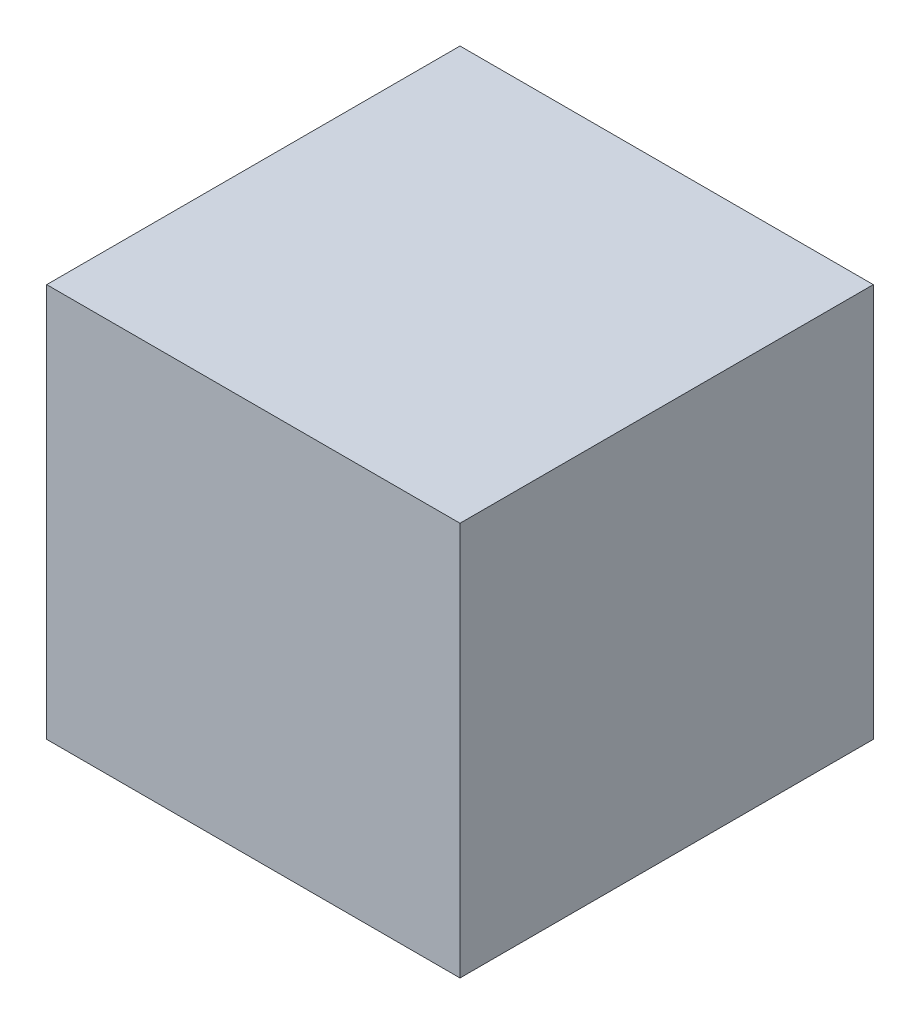
ISO-10303-21;
HEADER;
FILE_DESCRIPTION(('STEP AP214'),'2;1');
FILE_NAME('part.step','',(''),(''),'','','');
FILE_SCHEMA(('AUTOMOTIVE_DESIGN { 1 0 10303 214 1 1 1 1 }'));
ENDSEC;
DATA;
#1=APPLICATION_CONTEXT('core data for automotive mechanical design processes');
#2=APPLICATION_PROTOCOL_DEFINITION('international standard','automotive_design',2000,#1);
#3=PRODUCT_CONTEXT('',#1,'mechanical');
#4=PRODUCT('Part','Part','',(#3));
#5=PRODUCT_RELATED_PRODUCT_CATEGORY('part','',(#4));
#6=PRODUCT_DEFINITION_FORMATION('','',#4);
#7=PRODUCT_DEFINITION_CONTEXT('part definition',#1,'design');
#8=PRODUCT_DEFINITION('design','',#6,#7);
#9=PRODUCT_DEFINITION_SHAPE('','',#8);
#10=(LENGTH_UNIT() NAMED_UNIT(*) SI_UNIT(.MILLI.,.METRE.));
#11=(NAMED_UNIT(*) PLANE_ANGLE_UNIT() SI_UNIT($,.RADIAN.));
#12=(NAMED_UNIT(*) SI_UNIT($,.STERADIAN.) SOLID_ANGLE_UNIT());
#13=UNCERTAINTY_MEASURE_WITH_UNIT(LENGTH_MEASURE(1.E-05),#10,'distance_accuracy_value','');
#14=(GEOMETRIC_REPRESENTATION_CONTEXT(3) GLOBAL_UNCERTAINTY_ASSIGNED_CONTEXT((#13)) GLOBAL_UNIT_ASSIGNED_CONTEXT((#10,
#11,#12)) REPRESENTATION_CONTEXT('',''));
#15=CARTESIAN_POINT('',(0.,0.,0.));
#16=DIRECTION('',(0.,0.,1.));
#17=DIRECTION('',(1.,0.,0.));
#18=AXIS2_PLACEMENT_3D('',#15,#16,#17);
#19=CARTESIAN_POINT('',(0.,40.25,0.));
#20=DIRECTION('',(1.,0.,0.));
#21=DIRECTION('',(0.,0.,-1.));
#22=AXIS2_PLACEMENT_3D('',#19,#20,#21);
#23=PLANE('',#22);
#24=DIRECTION('',(0.,0.,1.));
#25=VECTOR('',#24,1.);
#26=CARTESIAN_POINT('',(0.,0.,0.));
#27=LINE('',#26,#25);
#28=CARTESIAN_POINT('',(0.,0.,-42.24));
#29=VERTEX_POINT('',#28);
#30=CARTESIAN_POINT('',(0.,0.,0.));
#31=VERTEX_POINT('',#30);
#32=EDGE_CURVE('E95',#29,#31,#27,.T.);
#33=ORIENTED_EDGE('',*,*,#32,.T.);
#34=DIRECTION('',(0.,-1.,0.));
#35=VECTOR('',#34,1.);
#36=CARTESIAN_POINT('',(0.,40.25,0.));
#37=LINE('',#36,#35);
#38=CARTESIAN_POINT('',(0.,40.25,0.));
#39=VERTEX_POINT('',#38);
#40=EDGE_CURVE('E11',#39,#31,#37,.T.);
#41=ORIENTED_EDGE('',*,*,#40,.F.);
#42=DIRECTION('',(0.,0.,1.));
#43=VECTOR('',#42,1.);
#44=CARTESIAN_POINT('',(0.,40.25,0.));
#45=LINE('',#44,#43);
#46=CARTESIAN_POINT('',(0.,40.25,-42.24));
#47=VERTEX_POINT('',#46);
#48=EDGE_CURVE('E83',#47,#39,#45,.T.);
#49=ORIENTED_EDGE('',*,*,#48,.F.);
#50=DIRECTION('',(0.,-1.,0.));
#51=VECTOR('',#50,1.);
#52=CARTESIAN_POINT('',(0.,40.25,-42.24));
#53=LINE('',#52,#51);
#54=EDGE_CURVE('E91',#47,#29,#53,.T.);
#55=ORIENTED_EDGE('',*,*,#54,.T.);
#56=EDGE_LOOP('',(#33,#41,#49,#55));
#57=FACE_BOUND('',#56,.T.);
#58=ADVANCED_FACE('F32',(#57),#23,.F.);
#59=CARTESIAN_POINT('',(0.,40.25,0.));
#60=DIRECTION('',(0.,0.,-1.));
#61=DIRECTION('',(-1.,0.,0.));
#62=AXIS2_PLACEMENT_3D('',#59,#60,#61);
#63=PLANE('',#62);
#64=DIRECTION('',(1.,0.,0.));
#65=VECTOR('',#64,1.);
#66=CARTESIAN_POINT('',(0.,0.,0.));
#67=LINE('',#66,#65);
#68=CARTESIAN_POINT('',(42.24,0.,0.));
#69=VERTEX_POINT('',#68);
#70=EDGE_CURVE('E87',#31,#69,#67,.T.);
#71=ORIENTED_EDGE('',*,*,#70,.T.);
#72=DIRECTION('',(0.,-1.,0.));
#73=VECTOR('',#72,1.);
#74=CARTESIAN_POINT('',(42.24,40.25,0.));
#75=LINE('',#74,#73);
#76=CARTESIAN_POINT('',(42.24,40.25,0.));
#77=VERTEX_POINT('',#76);
#78=EDGE_CURVE('E40',#77,#69,#75,.T.);
#79=ORIENTED_EDGE('',*,*,#78,.F.);
#80=DIRECTION('',(1.,0.,0.));
#81=VECTOR('',#80,1.);
#82=CARTESIAN_POINT('',(0.,40.25,0.));
#83=LINE('',#82,#81);
#84=EDGE_CURVE('E78',#39,#77,#83,.T.);
#85=ORIENTED_EDGE('',*,*,#84,.F.);
#86=ORIENTED_EDGE('',*,*,#40,.T.);
#87=EDGE_LOOP('',(#71,#79,#85,#86));
#88=FACE_BOUND('',#87,.T.);
#89=ADVANCED_FACE('F86',(#88),#63,.F.);
#90=CARTESIAN_POINT('',(42.24,40.25,0.));
#91=DIRECTION('',(-1.,0.,0.));
#92=DIRECTION('',(0.,0.,1.));
#93=AXIS2_PLACEMENT_3D('',#90,#91,#92);
#94=PLANE('',#93);
#95=DIRECTION('',(0.,0.,-1.));
#96=VECTOR('',#95,1.);
#97=CARTESIAN_POINT('',(42.24,0.,0.));
#98=LINE('',#97,#96);
#99=CARTESIAN_POINT('',(42.24,0.,-42.24));
#100=VERTEX_POINT('',#99);
#101=EDGE_CURVE('E65',#69,#100,#98,.T.);
#102=ORIENTED_EDGE('',*,*,#101,.T.);
#103=DIRECTION('',(0.,-1.,0.));
#104=VECTOR('',#103,1.);
#105=CARTESIAN_POINT('',(42.24,40.25,-42.24));
#106=LINE('',#105,#104);
#107=CARTESIAN_POINT('',(42.24,40.25,-42.24));
#108=VERTEX_POINT('',#107);
#109=EDGE_CURVE('E88',#108,#100,#106,.T.);
#110=ORIENTED_EDGE('',*,*,#109,.F.);
#111=DIRECTION('',(0.,0.,-1.));
#112=VECTOR('',#111,1.);
#113=CARTESIAN_POINT('',(42.24,40.25,0.));
#114=LINE('',#113,#112);
#115=EDGE_CURVE('E81',#77,#108,#114,.T.);
#116=ORIENTED_EDGE('',*,*,#115,.F.);
#117=ORIENTED_EDGE('',*,*,#78,.T.);
#118=EDGE_LOOP('',(#102,#110,#116,#117));
#119=FACE_BOUND('',#118,.T.);
#120=ADVANCED_FACE('F89',(#119),#94,.F.);
#121=CARTESIAN_POINT('',(0.,40.25,-42.24));
#122=DIRECTION('',(0.,0.,1.));
#123=DIRECTION('',(1.,0.,0.));
#124=AXIS2_PLACEMENT_3D('',#121,#122,#123);
#125=PLANE('',#124);
#126=DIRECTION('',(-1.,0.,0.));
#127=VECTOR('',#126,1.);
#128=CARTESIAN_POINT('',(0.,0.,-42.24));
#129=LINE('',#128,#127);
#130=EDGE_CURVE('E71',#100,#29,#129,.T.);
#131=ORIENTED_EDGE('',*,*,#130,.T.);
#132=ORIENTED_EDGE('',*,*,#54,.F.);
#133=DIRECTION('',(-1.,0.,0.));
#134=VECTOR('',#133,1.);
#135=CARTESIAN_POINT('',(0.,40.25,-42.24));
#136=LINE('',#135,#134);
#137=EDGE_CURVE('E48',#108,#47,#136,.T.);
#138=ORIENTED_EDGE('',*,*,#137,.F.);
#139=ORIENTED_EDGE('',*,*,#109,.T.);
#140=EDGE_LOOP('',(#131,#132,#138,#139));
#141=FACE_BOUND('',#140,.T.);
#142=ADVANCED_FACE('F102',(#141),#125,.F.);
#143=CARTESIAN_POINT('',(0.,40.25,0.));
#144=DIRECTION('',(0.,-1.,0.));
#145=DIRECTION('',(0.,0.,-1.));
#146=AXIS2_PLACEMENT_3D('',#143,#144,#145);
#147=PLANE('',#146);
#148=ORIENTED_EDGE('',*,*,#48,.T.);
#149=ORIENTED_EDGE('',*,*,#84,.T.);
#150=ORIENTED_EDGE('',*,*,#115,.T.);
#151=ORIENTED_EDGE('',*,*,#137,.T.);
#152=EDGE_LOOP('',(#148,#149,#150,#151));
#153=FACE_BOUND('',#152,.T.);
#154=ADVANCED_FACE('F79',(#153),#147,.F.);
#155=CARTESIAN_POINT('',(0.,0.,0.));
#156=DIRECTION('',(0.,-1.,0.));
#157=DIRECTION('',(0.,0.,-1.));
#158=AXIS2_PLACEMENT_3D('',#155,#156,#157);
#159=PLANE('',#158);
#160=ORIENTED_EDGE('',*,*,#32,.F.);
#161=ORIENTED_EDGE('',*,*,#130,.F.);
#162=ORIENTED_EDGE('',*,*,#101,.F.);
#163=ORIENTED_EDGE('',*,*,#70,.F.);
#164=EDGE_LOOP('',(#160,#161,#162,#163));
#165=FACE_BOUND('',#164,.T.);
#166=ADVANCED_FACE('F105',(#165),#159,.T.);
#167=CLOSED_SHELL('',(#58,#89,#120,#142,#154,#166));
#168=MANIFOLD_SOLID_BREP('B2',#167);
#169=ADVANCED_BREP_SHAPE_REPRESENTATION('',(#18,#168),#14);
#170=SHAPE_DEFINITION_REPRESENTATION(#9,#169);
ENDSEC;
END-ISO-10303-21;
